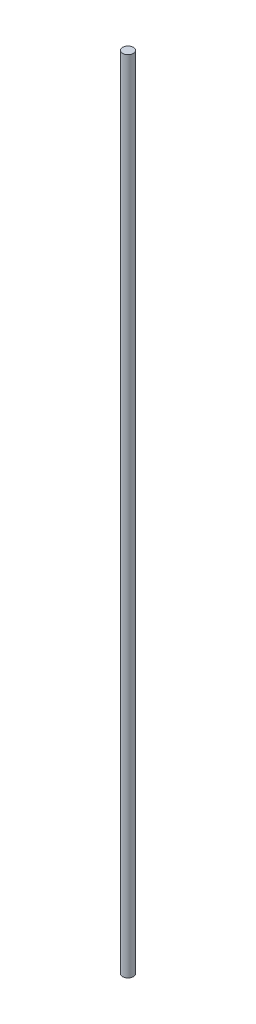
ISO-10303-21;
HEADER;
FILE_DESCRIPTION(('STEP AP214'),'2;1');
FILE_NAME('part.step','',(''),(''),'','','');
FILE_SCHEMA(('AUTOMOTIVE_DESIGN { 1 0 10303 214 1 1 1 1 }'));
ENDSEC;
DATA;
#1=APPLICATION_CONTEXT('core data for automotive mechanical design processes');
#2=APPLICATION_PROTOCOL_DEFINITION('international standard','automotive_design',2000,#1);
#3=PRODUCT_CONTEXT('',#1,'mechanical');
#4=PRODUCT('Part','Part','',(#3));
#5=PRODUCT_RELATED_PRODUCT_CATEGORY('part','',(#4));
#6=PRODUCT_DEFINITION_FORMATION('','',#4);
#7=PRODUCT_DEFINITION_CONTEXT('part definition',#1,'design');
#8=PRODUCT_DEFINITION('design','',#6,#7);
#9=PRODUCT_DEFINITION_SHAPE('','',#8);
#10=(LENGTH_UNIT() NAMED_UNIT(*) SI_UNIT(.MILLI.,.METRE.));
#11=(NAMED_UNIT(*) PLANE_ANGLE_UNIT() SI_UNIT($,.RADIAN.));
#12=(NAMED_UNIT(*) SI_UNIT($,.STERADIAN.) SOLID_ANGLE_UNIT());
#13=UNCERTAINTY_MEASURE_WITH_UNIT(LENGTH_MEASURE(1.E-05),#10,'distance_accuracy_value','');
#14=(GEOMETRIC_REPRESENTATION_CONTEXT(3) GLOBAL_UNCERTAINTY_ASSIGNED_CONTEXT((#13)) GLOBAL_UNIT_ASSIGNED_CONTEXT((#10,
#11,#12)) REPRESENTATION_CONTEXT('',''));
#15=CARTESIAN_POINT('',(0.,0.,0.));
#16=DIRECTION('',(0.,0.,1.));
#17=DIRECTION('',(1.,0.,0.));
#18=AXIS2_PLACEMENT_3D('',#15,#16,#17);
#19=CARTESIAN_POINT('',(0.,1500.,0.));
#20=DIRECTION('',(0.,-1.,0.));
#21=DIRECTION('',(0.,0.,-1.));
#22=AXIS2_PLACEMENT_3D('',#19,#20,#21);
#23=CYLINDRICAL_SURFACE('',#22,10.);
#24=CARTESIAN_POINT('',(0.,1500.,0.));
#25=DIRECTION('',(0.,1.,0.));
#26=DIRECTION('',(0.,0.,1.));
#27=AXIS2_PLACEMENT_3D('',#24,#25,#26);
#28=CIRCLE('',#27,10.);
#29=CARTESIAN_POINT('',(0.,1500.,10.));
#30=VERTEX_POINT('',#29);
#31=EDGE_CURVE('E10',#30,#30,#28,.T.);
#32=ORIENTED_EDGE('',*,*,#31,.F.);
#33=EDGE_LOOP('',(#32));
#34=FACE_BOUND('',#33,.T.);
#35=CARTESIAN_POINT('',(0.,0.,0.));
#36=DIRECTION('',(0.,1.,0.));
#37=DIRECTION('',(0.,0.,1.));
#38=AXIS2_PLACEMENT_3D('',#35,#36,#37);
#39=CIRCLE('',#38,10.);
#40=CARTESIAN_POINT('',(0.,0.,10.));
#41=VERTEX_POINT('',#40);
#42=EDGE_CURVE('E40',#41,#41,#39,.T.);
#43=ORIENTED_EDGE('',*,*,#42,.T.);
#44=EDGE_LOOP('',(#43));
#45=FACE_BOUND('',#44,.T.);
#46=ADVANCED_FACE('F37',(#34,#45),#23,.T.);
#47=CARTESIAN_POINT('',(0.,1500.,0.));
#48=DIRECTION('',(0.,1.,0.));
#49=DIRECTION('',(0.,0.,1.));
#50=AXIS2_PLACEMENT_3D('',#47,#48,#49);
#51=PLANE('',#50);
#52=ORIENTED_EDGE('',*,*,#31,.T.);
#53=EDGE_LOOP('',(#52));
#54=FACE_BOUND('',#53,.T.);
#55=ADVANCED_FACE('F54',(#54),#51,.T.);
#56=CARTESIAN_POINT('',(0.,0.,0.));
#57=DIRECTION('',(0.,1.,0.));
#58=DIRECTION('',(0.,0.,1.));
#59=AXIS2_PLACEMENT_3D('',#56,#57,#58);
#60=PLANE('',#59);
#61=ORIENTED_EDGE('',*,*,#42,.F.);
#62=EDGE_LOOP('',(#61));
#63=FACE_BOUND('',#62,.T.);
#64=ADVANCED_FACE('F52',(#63),#60,.F.);
#65=CLOSED_SHELL('',(#46,#55,#64));
#66=MANIFOLD_SOLID_BREP('B2',#65);
#67=ADVANCED_BREP_SHAPE_REPRESENTATION('',(#18,#66),#14);
#68=SHAPE_DEFINITION_REPRESENTATION(#9,#67);
ENDSEC;
END-ISO-10303-21;
